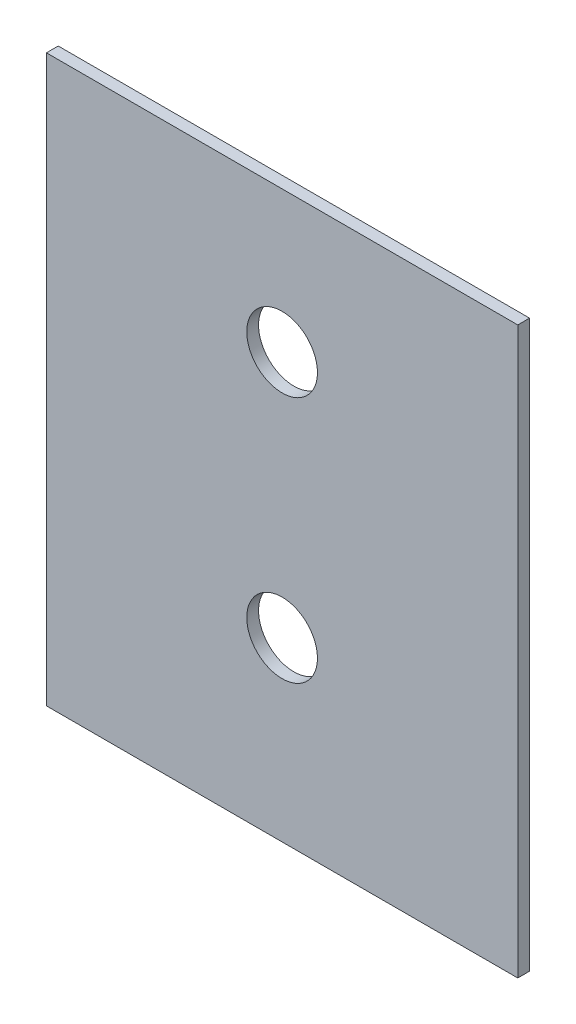
ISO-10303-21;
HEADER;
FILE_DESCRIPTION(('STEP AP214'),'2;1');
FILE_NAME('part.step','',(''),(''),'','','');
FILE_SCHEMA(('AUTOMOTIVE_DESIGN { 1 0 10303 214 1 1 1 1 }'));
ENDSEC;
DATA;
#1=APPLICATION_CONTEXT('core data for automotive mechanical design processes');
#2=APPLICATION_PROTOCOL_DEFINITION('international standard','automotive_design',2000,#1);
#3=PRODUCT_CONTEXT('',#1,'mechanical');
#4=PRODUCT('Part','Part','',(#3));
#5=PRODUCT_RELATED_PRODUCT_CATEGORY('part','',(#4));
#6=PRODUCT_DEFINITION_FORMATION('','',#4);
#7=PRODUCT_DEFINITION_CONTEXT('part definition',#1,'design');
#8=PRODUCT_DEFINITION('design','',#6,#7);
#9=PRODUCT_DEFINITION_SHAPE('','',#8);
#10=(LENGTH_UNIT() NAMED_UNIT(*) SI_UNIT(.MILLI.,.METRE.));
#11=(NAMED_UNIT(*) PLANE_ANGLE_UNIT() SI_UNIT($,.RADIAN.));
#12=(NAMED_UNIT(*) SI_UNIT($,.STERADIAN.) SOLID_ANGLE_UNIT());
#13=UNCERTAINTY_MEASURE_WITH_UNIT(LENGTH_MEASURE(1.E-05),#10,'distance_accuracy_value','');
#14=(GEOMETRIC_REPRESENTATION_CONTEXT(3) GLOBAL_UNCERTAINTY_ASSIGNED_CONTEXT((#13)) GLOBAL_UNIT_ASSIGNED_CONTEXT((#10,
#11,#12)) REPRESENTATION_CONTEXT('',''));
#15=CARTESIAN_POINT('',(0.,0.,0.));
#16=DIRECTION('',(0.,0.,1.));
#17=DIRECTION('',(1.,0.,0.));
#18=AXIS2_PLACEMENT_3D('',#15,#16,#17);
#19=CARTESIAN_POINT('',(0.,620.096950052034,10.));
#20=DIRECTION('',(0.,0.,-1.));
#21=DIRECTION('',(-1.,0.,0.));
#22=AXIS2_PLACEMENT_3D('',#19,#20,#21);
#23=PLANE('',#22);
#24=CARTESIAN_POINT('',(200.,770.096950052034,10.0000000000001));
#25=DIRECTION('',(0.,0.,-1.));
#26=DIRECTION('',(1.,0.,0.));
#27=AXIS2_PLACEMENT_3D('',#24,#25,#26);
#28=CIRCLE('',#27,30.);
#29=CARTESIAN_POINT('',(230.,770.096950052034,10.0000000000001));
#30=VERTEX_POINT('',#29);
#31=EDGE_CURVE('E100',#30,#30,#28,.T.);
#32=ORIENTED_EDGE('',*,*,#31,.T.);
#33=EDGE_LOOP('',(#32));
#34=FACE_BOUND('',#33,.T.);
#35=DIRECTION('',(0.,1.,0.));
#36=VECTOR('',#35,1.);
#37=CARTESIAN_POINT('',(0.,1100.09695005203,10.0000000000003));
#38=LINE('',#37,#36);
#39=CARTESIAN_POINT('',(0.,620.096950052034,10.));
#40=VERTEX_POINT('',#39);
#41=CARTESIAN_POINT('',(0.,1100.09695005203,10.0000000000003));
#42=VERTEX_POINT('',#41);
#43=EDGE_CURVE('E88',#40,#42,#38,.T.);
#44=ORIENTED_EDGE('',*,*,#43,.F.);
#45=DIRECTION('',(-1.,0.,0.));
#46=VECTOR('',#45,1.);
#47=CARTESIAN_POINT('',(0.,620.096950052034,10.));
#48=LINE('',#47,#46);
#49=CARTESIAN_POINT('',(400.,620.096950052034,10.));
#50=VERTEX_POINT('',#49);
#51=EDGE_CURVE('E91',#50,#40,#48,.T.);
#52=ORIENTED_EDGE('',*,*,#51,.F.);
#53=DIRECTION('',(0.,-1.,0.));
#54=VECTOR('',#53,1.);
#55=CARTESIAN_POINT('',(400.,1100.09695005203,10.0000000000003));
#56=LINE('',#55,#54);
#57=CARTESIAN_POINT('',(400.,1100.09695005203,10.0000000000003));
#58=VERTEX_POINT('',#57);
#59=EDGE_CURVE('E79',#58,#50,#56,.T.);
#60=ORIENTED_EDGE('',*,*,#59,.F.);
#61=DIRECTION('',(1.,0.,0.));
#62=VECTOR('',#61,1.);
#63=CARTESIAN_POINT('',(0.,1100.09695005203,10.0000000000003));
#64=LINE('',#63,#62);
#65=EDGE_CURVE('E84',#42,#58,#64,.T.);
#66=ORIENTED_EDGE('',*,*,#65,.F.);
#67=EDGE_LOOP('',(#44,#52,#60,#66));
#68=FACE_BOUND('',#67,.T.);
#69=CARTESIAN_POINT('',(200.,980.096950052034,10.0000000000002));
#70=DIRECTION('',(0.,0.,-1.));
#71=DIRECTION('',(1.,0.,0.));
#72=AXIS2_PLACEMENT_3D('',#69,#70,#71);
#73=CIRCLE('',#72,30.0000000000001);
#74=CARTESIAN_POINT('',(230.,980.096950052034,10.0000000000002));
#75=VERTEX_POINT('',#74);
#76=EDGE_CURVE('E111',#75,#75,#73,.T.);
#77=ORIENTED_EDGE('',*,*,#76,.T.);
#78=EDGE_LOOP('',(#77));
#79=FACE_BOUND('',#78,.T.);
#80=ADVANCED_FACE('F32',(#34,#68,#79),#23,.F.);
#81=CARTESIAN_POINT('',(0.,620.096950052034,0.));
#82=DIRECTION('',(0.,0.,-1.));
#83=DIRECTION('',(-1.,0.,0.));
#84=AXIS2_PLACEMENT_3D('',#81,#82,#83);
#85=PLANE('',#84);
#86=CARTESIAN_POINT('',(200.,770.096950052034,1.01484035790306E-13));
#87=DIRECTION('',(0.,0.,-1.));
#88=DIRECTION('',(1.,0.,0.));
#89=AXIS2_PLACEMENT_3D('',#86,#87,#88);
#90=CIRCLE('',#89,30.);
#91=CARTESIAN_POINT('',(230.,770.096950052034,1.01484035790306E-13));
#92=VERTEX_POINT('',#91);
#93=EDGE_CURVE('E108',#92,#92,#90,.T.);
#94=ORIENTED_EDGE('',*,*,#93,.F.);
#95=EDGE_LOOP('',(#94));
#96=FACE_BOUND('',#95,.T.);
#97=DIRECTION('',(0.,1.,0.));
#98=VECTOR('',#97,1.);
#99=CARTESIAN_POINT('',(0.,1100.09695005203,2.53676555219679E-13));
#100=LINE('',#99,#98);
#101=CARTESIAN_POINT('',(0.,620.096950052034,0.));
#102=VERTEX_POINT('',#101);
#103=CARTESIAN_POINT('',(0.,1100.09695005203,2.53676555219679E-13));
#104=VERTEX_POINT('',#103);
#105=EDGE_CURVE('E96',#102,#104,#100,.T.);
#106=ORIENTED_EDGE('',*,*,#105,.T.);
#107=DIRECTION('',(1.,0.,0.));
#108=VECTOR('',#107,1.);
#109=CARTESIAN_POINT('',(0.,1100.09695005203,2.53676555219679E-13));
#110=LINE('',#109,#108);
#111=CARTESIAN_POINT('',(400.,1100.09695005203,2.53676555219679E-13));
#112=VERTEX_POINT('',#111);
#113=EDGE_CURVE('E99',#104,#112,#110,.T.);
#114=ORIENTED_EDGE('',*,*,#113,.T.);
#115=DIRECTION('',(0.,-1.,0.));
#116=VECTOR('',#115,1.);
#117=CARTESIAN_POINT('',(400.,1100.09695005203,2.53676555219679E-13));
#118=LINE('',#117,#116);
#119=CARTESIAN_POINT('',(400.,620.096950052034,0.));
#120=VERTEX_POINT('',#119);
#121=EDGE_CURVE('E82',#112,#120,#118,.T.);
#122=ORIENTED_EDGE('',*,*,#121,.T.);
#123=DIRECTION('',(-1.,0.,0.));
#124=VECTOR('',#123,1.);
#125=CARTESIAN_POINT('',(0.,620.096950052034,0.));
#126=LINE('',#125,#124);
#127=EDGE_CURVE('E103',#120,#102,#126,.T.);
#128=ORIENTED_EDGE('',*,*,#127,.T.);
#129=EDGE_LOOP('',(#106,#114,#122,#128));
#130=FACE_BOUND('',#129,.T.);
#131=CARTESIAN_POINT('',(200.,980.096950052034,1.98333820881725E-13));
#132=DIRECTION('',(0.,0.,-1.));
#133=DIRECTION('',(1.,0.,0.));
#134=AXIS2_PLACEMENT_3D('',#131,#132,#133);
#135=CIRCLE('',#134,30.0000000000001);
#136=CARTESIAN_POINT('',(230.,980.096950052034,1.98333820881725E-13));
#137=VERTEX_POINT('',#136);
#138=EDGE_CURVE('E114',#137,#137,#135,.T.);
#139=ORIENTED_EDGE('',*,*,#138,.F.);
#140=EDGE_LOOP('',(#139));
#141=FACE_BOUND('',#140,.T.);
#142=ADVANCED_FACE('F127',(#96,#130,#141),#85,.T.);
#143=CARTESIAN_POINT('',(0.,1100.09695005203,10.0000000000003));
#144=DIRECTION('',(1.,0.,0.));
#145=DIRECTION('',(0.,0.,-1.));
#146=AXIS2_PLACEMENT_3D('',#143,#144,#145);
#147=PLANE('',#146);
#148=ORIENTED_EDGE('',*,*,#105,.F.);
#149=DIRECTION('',(0.,0.,-1.));
#150=VECTOR('',#149,1.);
#151=CARTESIAN_POINT('',(0.,620.096950052034,10.));
#152=LINE('',#151,#150);
#153=EDGE_CURVE('E49',#40,#102,#152,.T.);
#154=ORIENTED_EDGE('',*,*,#153,.F.);
#155=ORIENTED_EDGE('',*,*,#43,.T.);
#156=DIRECTION('',(0.,0.,-1.));
#157=VECTOR('',#156,1.);
#158=CARTESIAN_POINT('',(0.,1100.09695005203,10.0000000000003));
#159=LINE('',#158,#157);
#160=EDGE_CURVE('E11',#42,#104,#159,.T.);
#161=ORIENTED_EDGE('',*,*,#160,.T.);
#162=EDGE_LOOP('',(#148,#154,#155,#161));
#163=FACE_BOUND('',#162,.T.);
#164=ADVANCED_FACE('F34',(#163),#147,.F.);
#165=CARTESIAN_POINT('',(0.,1100.09695005203,10.0000000000003));
#166=DIRECTION('',(0.,-1.,0.));
#167=DIRECTION('',(0.,0.,1.));
#168=AXIS2_PLACEMENT_3D('',#165,#166,#167);
#169=PLANE('',#168);
#170=ORIENTED_EDGE('',*,*,#113,.F.);
#171=ORIENTED_EDGE('',*,*,#160,.F.);
#172=ORIENTED_EDGE('',*,*,#65,.T.);
#173=DIRECTION('',(0.,0.,-1.));
#174=VECTOR('',#173,1.);
#175=CARTESIAN_POINT('',(400.,1100.09695005203,10.0000000000003));
#176=LINE('',#175,#174);
#177=EDGE_CURVE('E41',#58,#112,#176,.T.);
#178=ORIENTED_EDGE('',*,*,#177,.T.);
#179=EDGE_LOOP('',(#170,#171,#172,#178));
#180=FACE_BOUND('',#179,.T.);
#181=ADVANCED_FACE('F85',(#180),#169,.F.);
#182=CARTESIAN_POINT('',(400.,1100.09695005203,10.0000000000003));
#183=DIRECTION('',(-1.,0.,0.));
#184=DIRECTION('',(0.,0.,1.));
#185=AXIS2_PLACEMENT_3D('',#182,#183,#184);
#186=PLANE('',#185);
#187=ORIENTED_EDGE('',*,*,#121,.F.);
#188=ORIENTED_EDGE('',*,*,#177,.F.);
#189=ORIENTED_EDGE('',*,*,#59,.T.);
#190=DIRECTION('',(0.,0.,-1.));
#191=VECTOR('',#190,1.);
#192=CARTESIAN_POINT('',(400.,620.096950052034,10.));
#193=LINE('',#192,#191);
#194=EDGE_CURVE('E65',#50,#120,#193,.T.);
#195=ORIENTED_EDGE('',*,*,#194,.T.);
#196=EDGE_LOOP('',(#187,#188,#189,#195));
#197=FACE_BOUND('',#196,.T.);
#198=ADVANCED_FACE('F77',(#197),#186,.F.);
#199=CARTESIAN_POINT('',(0.,620.096950052034,10.));
#200=DIRECTION('',(0.,1.,0.));
#201=DIRECTION('',(0.,0.,-1.));
#202=AXIS2_PLACEMENT_3D('',#199,#200,#201);
#203=PLANE('',#202);
#204=ORIENTED_EDGE('',*,*,#127,.F.);
#205=ORIENTED_EDGE('',*,*,#194,.F.);
#206=ORIENTED_EDGE('',*,*,#51,.T.);
#207=ORIENTED_EDGE('',*,*,#153,.T.);
#208=EDGE_LOOP('',(#204,#205,#206,#207));
#209=FACE_BOUND('',#208,.T.);
#210=ADVANCED_FACE('F140',(#209),#203,.F.);
#211=CARTESIAN_POINT('',(200.,770.096950052034,10.0000000000001));
#212=DIRECTION('',(0.,0.,-1.));
#213=DIRECTION('',(-1.,0.,0.));
#214=AXIS2_PLACEMENT_3D('',#211,#212,#213);
#215=CYLINDRICAL_SURFACE('',#214,30.);
#216=ORIENTED_EDGE('',*,*,#31,.F.);
#217=EDGE_LOOP('',(#216));
#218=FACE_BOUND('',#217,.T.);
#219=ORIENTED_EDGE('',*,*,#93,.T.);
#220=EDGE_LOOP('',(#219));
#221=FACE_BOUND('',#220,.T.);
#222=ADVANCED_FACE('F123',(#218,#221),#215,.F.);
#223=CARTESIAN_POINT('',(200.,980.096950052034,10.0000000000002));
#224=DIRECTION('',(0.,0.,-1.));
#225=DIRECTION('',(-1.,0.,0.));
#226=AXIS2_PLACEMENT_3D('',#223,#224,#225);
#227=CYLINDRICAL_SURFACE('',#226,30.0000000000001);
#228=ORIENTED_EDGE('',*,*,#76,.F.);
#229=EDGE_LOOP('',(#228));
#230=FACE_BOUND('',#229,.T.);
#231=ORIENTED_EDGE('',*,*,#138,.T.);
#232=EDGE_LOOP('',(#231));
#233=FACE_BOUND('',#232,.T.);
#234=ADVANCED_FACE('F120',(#230,#233),#227,.F.);
#235=CLOSED_SHELL('',(#80,#142,#164,#181,#198,#210,#222,#234));
#236=MANIFOLD_SOLID_BREP('B2',#235);
#237=ADVANCED_BREP_SHAPE_REPRESENTATION('',(#18,#236),#14);
#238=SHAPE_DEFINITION_REPRESENTATION(#9,#237);
ENDSEC;
END-ISO-10303-21;
